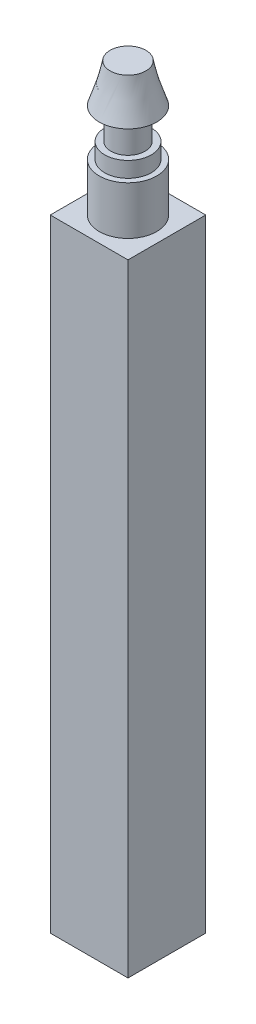
ISO-10303-21;
HEADER;
FILE_DESCRIPTION(('STEP AP214'),'2;1');
FILE_NAME('part.step','',(''),(''),'','','');
FILE_SCHEMA(('AUTOMOTIVE_DESIGN { 1 0 10303 214 1 1 1 1 }'));
ENDSEC;
DATA;
#1=APPLICATION_CONTEXT('core data for automotive mechanical design processes');
#2=APPLICATION_PROTOCOL_DEFINITION('international standard','automotive_design',2000,#1);
#3=PRODUCT_CONTEXT('',#1,'mechanical');
#4=PRODUCT('Part','Part','',(#3));
#5=PRODUCT_RELATED_PRODUCT_CATEGORY('part','',(#4));
#6=PRODUCT_DEFINITION_FORMATION('','',#4);
#7=PRODUCT_DEFINITION_CONTEXT('part definition',#1,'design');
#8=PRODUCT_DEFINITION('design','',#6,#7);
#9=PRODUCT_DEFINITION_SHAPE('','',#8);
#10=(LENGTH_UNIT() NAMED_UNIT(*) SI_UNIT(.MILLI.,.METRE.));
#11=(NAMED_UNIT(*) PLANE_ANGLE_UNIT() SI_UNIT($,.RADIAN.));
#12=(NAMED_UNIT(*) SI_UNIT($,.STERADIAN.) SOLID_ANGLE_UNIT());
#13=UNCERTAINTY_MEASURE_WITH_UNIT(LENGTH_MEASURE(1.E-05),#10,'distance_accuracy_value','');
#14=(GEOMETRIC_REPRESENTATION_CONTEXT(3) GLOBAL_UNCERTAINTY_ASSIGNED_CONTEXT((#13)) GLOBAL_UNIT_ASSIGNED_CONTEXT((#10,
#11,#12)) REPRESENTATION_CONTEXT('',''));
#15=CARTESIAN_POINT('',(0.,0.,0.));
#16=DIRECTION('',(0.,0.,1.));
#17=DIRECTION('',(1.,0.,0.));
#18=AXIS2_PLACEMENT_3D('',#15,#16,#17);
#19=CARTESIAN_POINT('',(0.,3.1,0.));
#20=DIRECTION('',(0.,-1.,0.));
#21=DIRECTION('',(0.,0.,-1.));
#22=AXIS2_PLACEMENT_3D('',#19,#20,#21);
#23=CYLINDRICAL_SURFACE('',#22,1.85);
#24=CARTESIAN_POINT('',(0.,3.1,0.));
#25=DIRECTION('',(0.,1.,0.));
#26=DIRECTION('',(0.,0.,1.));
#27=AXIS2_PLACEMENT_3D('',#24,#25,#26);
#28=CIRCLE('',#27,1.85);
#29=CARTESIAN_POINT('',(0.,3.1,-1.85));
#30=VERTEX_POINT('',#29);
#31=EDGE_CURVE('E174',#30,#30,#28,.T.);
#32=CARTESIAN_POINT('',(0.,0.,0.));
#33=DIRECTION('',(0.,1.,0.));
#34=DIRECTION('',(0.,0.,1.));
#35=AXIS2_PLACEMENT_3D('',#32,#33,#34);
#36=CIRCLE('',#35,1.85);
#37=CARTESIAN_POINT('',(0.,0.,-1.85));
#38=VERTEX_POINT('',#37);
#39=EDGE_CURVE('E41',#38,#38,#36,.T.);
#40=CARTESIAN_POINT('',(0.,3.1,-1.85));
#41=CARTESIAN_POINT('',(0.,3.06770833333333,-1.85));
#42=CARTESIAN_POINT('',(0.,3.03541666666667,-1.85));
#43=CARTESIAN_POINT('',(0.,2.97083333333333,-1.85));
#44=CARTESIAN_POINT('',(0.,2.93854166666667,-1.85));
#45=CARTESIAN_POINT('',(0.,2.87395833333333,-1.85));
#46=CARTESIAN_POINT('',(0.,2.84166666666667,-1.85));
#47=CARTESIAN_POINT('',(0.,2.77708333333333,-1.85));
#48=CARTESIAN_POINT('',(0.,2.74479166666667,-1.85));
#49=CARTESIAN_POINT('',(0.,2.68020833333333,-1.85));
#50=CARTESIAN_POINT('',(0.,2.64791666666667,-1.85));
#51=CARTESIAN_POINT('',(0.,2.58333333333333,-1.85));
#52=CARTESIAN_POINT('',(0.,2.55104166666667,-1.85));
#53=CARTESIAN_POINT('',(0.,2.48645833333333,-1.85));
#54=CARTESIAN_POINT('',(0.,2.45416666666667,-1.85));
#55=CARTESIAN_POINT('',(0.,2.38958333333333,-1.85));
#56=CARTESIAN_POINT('',(0.,2.35729166666667,-1.85));
#57=CARTESIAN_POINT('',(0.,2.29270833333333,-1.85));
#58=CARTESIAN_POINT('',(0.,2.26041666666667,-1.85));
#59=CARTESIAN_POINT('',(0.,2.19583333333333,-1.85));
#60=CARTESIAN_POINT('',(0.,2.16354166666667,-1.85));
#61=CARTESIAN_POINT('',(0.,2.09895833333333,-1.85));
#62=CARTESIAN_POINT('',(0.,2.06666666666667,-1.85));
#63=CARTESIAN_POINT('',(0.,2.00208333333333,-1.85));
#64=CARTESIAN_POINT('',(0.,1.96979166666667,-1.85));
#65=CARTESIAN_POINT('',(0.,1.90520833333333,-1.85));
#66=CARTESIAN_POINT('',(0.,1.87291666666667,-1.85));
#67=CARTESIAN_POINT('',(0.,1.80833333333333,-1.85));
#68=CARTESIAN_POINT('',(0.,1.77604166666667,-1.85));
#69=CARTESIAN_POINT('',(0.,1.71145833333333,-1.85));
#70=CARTESIAN_POINT('',(0.,1.67916666666667,-1.85));
#71=CARTESIAN_POINT('',(0.,1.61458333333333,-1.85));
#72=CARTESIAN_POINT('',(0.,1.58229166666667,-1.85));
#73=CARTESIAN_POINT('',(0.,1.51770833333333,-1.85));
#74=CARTESIAN_POINT('',(0.,1.48541666666667,-1.85));
#75=CARTESIAN_POINT('',(0.,1.42083333333333,-1.85));
#76=CARTESIAN_POINT('',(0.,1.38854166666667,-1.85));
#77=CARTESIAN_POINT('',(0.,1.32395833333333,-1.85));
#78=CARTESIAN_POINT('',(0.,1.29166666666667,-1.85));
#79=CARTESIAN_POINT('',(0.,1.22708333333333,-1.85));
#80=CARTESIAN_POINT('',(0.,1.19479166666667,-1.85));
#81=CARTESIAN_POINT('',(0.,1.13020833333333,-1.85));
#82=CARTESIAN_POINT('',(0.,1.09791666666667,-1.85));
#83=CARTESIAN_POINT('',(0.,1.03333333333333,-1.85));
#84=CARTESIAN_POINT('',(0.,1.00104166666667,-1.85));
#85=CARTESIAN_POINT('',(0.,0.936458333333333,-1.85));
#86=CARTESIAN_POINT('',(0.,0.904166666666667,-1.85));
#87=CARTESIAN_POINT('',(0.,0.839583333333333,-1.85));
#88=CARTESIAN_POINT('',(0.,0.807291666666667,-1.85));
#89=CARTESIAN_POINT('',(0.,0.742708333333333,-1.85));
#90=CARTESIAN_POINT('',(0.,0.710416666666667,-1.85));
#91=CARTESIAN_POINT('',(0.,0.645833333333333,-1.85));
#92=CARTESIAN_POINT('',(0.,0.613541666666667,-1.85));
#93=CARTESIAN_POINT('',(0.,0.548958333333333,-1.85));
#94=CARTESIAN_POINT('',(0.,0.516666666666667,-1.85));
#95=CARTESIAN_POINT('',(0.,0.452083333333333,-1.85));
#96=CARTESIAN_POINT('',(0.,0.419791666666667,-1.85));
#97=CARTESIAN_POINT('',(0.,0.355208333333333,-1.85));
#98=CARTESIAN_POINT('',(0.,0.322916666666667,-1.85));
#99=CARTESIAN_POINT('',(0.,0.258333333333333,-1.85));
#100=CARTESIAN_POINT('',(0.,0.226041666666667,-1.85));
#101=CARTESIAN_POINT('',(0.,0.161458333333333,-1.85));
#102=CARTESIAN_POINT('',(0.,0.129166666666667,-1.85));
#103=CARTESIAN_POINT('',(0.,0.0645833333333335,-1.85));
#104=CARTESIAN_POINT('',(0.,0.0322916666666667,-1.85));
#105=CARTESIAN_POINT('',(0.,0.,-1.85));
#106=B_SPLINE_CURVE_WITH_KNOTS('',3,(#40,#41,#42,#43,#44,#45,#46,#47,#48,#49,#50,#51,#52,#53,
#54,#55,#56,#57,#58,#59,#60,#61,#62,#63,#64,#65,#66,#67,#68,#69,#70,#71,#72,#73,#74,#75,#76,#77,
#78,#79,#80,#81,#82,#83,#84,#85,#86,#87,#88,#89,#90,#91,#92,#93,#94,#95,#96,#97,#98,#99,#100,
#101,#102,#103,#104,#105),.UNSPECIFIED.,.F.,.F.,(4,2,2,2,2,2,2,2,2,2,2,2,2,2,2,2,2,2,2,2,2,2,2,
2,2,2,2,2,2,2,2,2,4),(0.,0.0968749999999997,0.19375,0.290625,0.3875,0.484375,0.58125,0.678125,
0.775,0.871874999999999,0.96875,1.065625,1.1625,1.259375,1.35625,1.453125,1.55,1.646875,1.74375,
1.840625,1.9375,2.034375,2.13125,2.228125,2.325,2.421875,2.51875,2.615625,2.7125,2.809375,
2.90625,3.003125,3.1),.UNSPECIFIED.);
#107=EDGE_CURVE('BSEAM38',#30,#38,#106,.T.);
#108=ORIENTED_EDGE('',*,*,#31,.F.);
#109=ORIENTED_EDGE('',*,*,#39,.T.);
#110=ORIENTED_EDGE('',*,*,#107,.T.);
#111=ORIENTED_EDGE('',*,*,#107,.F.);
#112=EDGE_LOOP('',(#108,#110,#109,#111));
#113=FACE_BOUND('',#112,.T.);
#114=ADVANCED_FACE('F38',(#113),#23,.T.);
#115=CARTESIAN_POINT('',(0.,3.1,0.));
#116=DIRECTION('',(0.,1.,0.));
#117=DIRECTION('',(0.,0.,1.));
#118=AXIS2_PLACEMENT_3D('',#115,#116,#117);
#119=PLANE('',#118);
#120=CARTESIAN_POINT('',(0.,3.1,0.));
#121=DIRECTION('',(0.,1.,0.));
#122=DIRECTION('',(0.,0.,1.));
#123=AXIS2_PLACEMENT_3D('',#120,#121,#122);
#124=CIRCLE('',#123,1.5);
#125=CARTESIAN_POINT('',(0.,3.1,1.5));
#126=VERTEX_POINT('',#125);
#127=EDGE_CURVE('E47',#126,#126,#124,.T.);
#128=ORIENTED_EDGE('',*,*,#127,.F.);
#129=EDGE_LOOP('',(#128));
#130=FACE_BOUND('',#129,.T.);
#131=ORIENTED_EDGE('',*,*,#31,.T.);
#132=EDGE_LOOP('',(#131));
#133=FACE_BOUND('',#132,.T.);
#134=ADVANCED_FACE('F179',(#130,#133),#119,.T.);
#135=CARTESIAN_POINT('',(0.,4.1,0.));
#136=DIRECTION('',(0.,-1.,0.));
#137=DIRECTION('',(0.,0.,-1.));
#138=AXIS2_PLACEMENT_3D('',#135,#136,#137);
#139=CYLINDRICAL_SURFACE('',#138,1.5);
#140=CARTESIAN_POINT('',(0.,4.1,0.));
#141=DIRECTION('',(0.,1.,0.));
#142=DIRECTION('',(0.,0.,1.));
#143=AXIS2_PLACEMENT_3D('',#140,#141,#142);
#144=CIRCLE('',#143,1.5);
#145=CARTESIAN_POINT('',(0.,4.1,1.5));
#146=VERTEX_POINT('',#145);
#147=EDGE_CURVE('E170',#146,#146,#144,.T.);
#148=ORIENTED_EDGE('',*,*,#147,.F.);
#149=EDGE_LOOP('',(#148));
#150=FACE_BOUND('',#149,.T.);
#151=ORIENTED_EDGE('',*,*,#127,.T.);
#152=EDGE_LOOP('',(#151));
#153=FACE_BOUND('',#152,.T.);
#154=ADVANCED_FACE('F202',(#150,#153),#139,.T.);
#155=CARTESIAN_POINT('',(0.,4.1,0.));
#156=DIRECTION('',(0.,1.,0.));
#157=DIRECTION('',(0.,0.,1.));
#158=AXIS2_PLACEMENT_3D('',#155,#156,#157);
#159=PLANE('',#158);
#160=CARTESIAN_POINT('',(0.,4.1,0.));
#161=DIRECTION('',(0.,1.,0.));
#162=DIRECTION('',(0.,0.,1.));
#163=AXIS2_PLACEMENT_3D('',#160,#161,#162);
#164=CIRCLE('',#163,1.1);
#165=CARTESIAN_POINT('',(0.,4.1,1.1));
#166=VERTEX_POINT('',#165);
#167=EDGE_CURVE('E12',#166,#166,#164,.T.);
#168=ORIENTED_EDGE('',*,*,#167,.F.);
#169=EDGE_LOOP('',(#168));
#170=FACE_BOUND('',#169,.T.);
#171=ORIENTED_EDGE('',*,*,#147,.T.);
#172=EDGE_LOOP('',(#171));
#173=FACE_BOUND('',#172,.T.);
#174=ADVANCED_FACE('F197',(#170,#173),#159,.T.);
#175=CARTESIAN_POINT('',(0.,6.1,0.));
#176=DIRECTION('',(0.,-1.,0.));
#177=DIRECTION('',(0.,0.,-1.));
#178=AXIS2_PLACEMENT_3D('',#175,#176,#177);
#179=CYLINDRICAL_SURFACE('',#178,1.1);
#180=CARTESIAN_POINT('',(0.,6.1,0.));
#181=DIRECTION('',(0.,1.,0.));
#182=DIRECTION('',(0.,0.,1.));
#183=AXIS2_PLACEMENT_3D('',#180,#181,#182);
#184=CIRCLE('',#183,1.1);
#185=CARTESIAN_POINT('',(0.,6.1,1.1));
#186=VERTEX_POINT('',#185);
#187=EDGE_CURVE('E166',#186,#186,#184,.T.);
#188=ORIENTED_EDGE('',*,*,#187,.F.);
#189=EDGE_LOOP('',(#188));
#190=FACE_BOUND('',#189,.T.);
#191=ORIENTED_EDGE('',*,*,#167,.T.);
#192=EDGE_LOOP('',(#191));
#193=FACE_BOUND('',#192,.T.);
#194=ADVANCED_FACE('F153',(#190,#193),#179,.T.);
#195=CARTESIAN_POINT('',(0.,8.6,0.));
#196=DIRECTION('',(0.,1.,0.));
#197=DIRECTION('',(0.,0.,1.));
#198=AXIS2_PLACEMENT_3D('',#195,#196,#197);
#199=PLANE('',#198);
#200=CARTESIAN_POINT('',(0.,8.6,0.));
#201=DIRECTION('',(0.,1.,0.));
#202=DIRECTION('',(0.,0.,1.));
#203=AXIS2_PLACEMENT_3D('',#200,#201,#202);
#204=CIRCLE('',#203,1.15);
#205=CARTESIAN_POINT('',(0.620465420838555,8.6,0.968257538851949));
#206=VERTEX_POINT('',#205);
#207=EDGE_CURVE('E121',#206,#206,#204,.T.);
#208=ORIENTED_EDGE('',*,*,#207,.T.);
#209=EDGE_LOOP('',(#208));
#210=FACE_BOUND('',#209,.T.);
#211=ADVANCED_FACE('F144',(#210),#199,.T.);
#212=CARTESIAN_POINT('',(0.,6.1,0.));
#213=DIRECTION('',(0.,1.,0.));
#214=DIRECTION('',(0.,0.,1.));
#215=AXIS2_PLACEMENT_3D('',#212,#213,#214);
#216=PLANE('',#215);
#217=ORIENTED_EDGE('',*,*,#187,.T.);
#218=EDGE_LOOP('',(#217));
#219=FACE_BOUND('',#218,.T.);
#220=CARTESIAN_POINT('',(0.,6.1,0.));
#221=DIRECTION('',(0.,1.,0.));
#222=DIRECTION('',(0.,0.,1.));
#223=AXIS2_PLACEMENT_3D('',#220,#221,#222);
#224=CIRCLE('',#223,1.85);
#225=CARTESIAN_POINT('',(0.,6.1,1.85));
#226=VERTEX_POINT('',#225);
#227=EDGE_CURVE('E126',#226,#226,#224,.T.);
#228=ORIENTED_EDGE('',*,*,#227,.F.);
#229=EDGE_LOOP('',(#228));
#230=FACE_BOUND('',#229,.T.);
#231=ADVANCED_FACE('F141',(#219,#230),#216,.F.);
#232=CARTESIAN_POINT('',(0.,6.1,1.85));
#233=CARTESIAN_POINT('',(0.620465420838555,8.6,0.968257538851949));
#234=CARTESIAN_POINT('',(3.7,6.1,1.85));
#235=CARTESIAN_POINT('',(2.55698049854245,8.6,-0.272673302825161));
#236=CARTESIAN_POINT('',(3.7,6.1,-1.85));
#237=CARTESIAN_POINT('',(1.31604965686534,8.6,-2.20918838052906));
#238=CARTESIAN_POINT('',(0.,6.1,-1.85));
#239=CARTESIAN_POINT('',(-0.620465420838555,8.6,-0.96825753885195));
#240=CARTESIAN_POINT('',(-3.7,6.1,-1.85));
#241=CARTESIAN_POINT('',(-2.55698049854246,8.6,0.272673302825162));
#242=CARTESIAN_POINT('',(-3.7,6.1,1.85));
#243=CARTESIAN_POINT('',(-1.31604965686534,8.6,2.20918838052906));
#244=CARTESIAN_POINT('',(0.,6.1,1.85));
#245=CARTESIAN_POINT('',(0.620465420838555,8.6,0.968257538851949));
#246=(BOUNDED_SURFACE() B_SPLINE_SURFACE(3,1,((#232,#233),(#234,#235),(#236,#237),(#238,#239),
(#240,#241),(#242,#243),(#244,#245)),.UNSPECIFIED.,.T.,.F.,.F.) B_SPLINE_SURFACE_WITH_KNOTS((4,
3,4),(2,2),(0.,0.5,1.),(0.,1.),
.UNSPECIFIED.) GEOMETRIC_REPRESENTATION_ITEM() RATIONAL_B_SPLINE_SURFACE(((1.,1.),
(0.333333333333333,0.333333333333333),(0.333333333333333,0.333333333333333),(1.,1.),
(0.333333333333333,0.333333333333333),(0.333333333333333,0.333333333333333),(1.,1.))) REPRESENTATION_ITEM('') SURFACE());
#247=CARTESIAN_POINT('',(0.,6.1,1.85));
#248=CARTESIAN_POINT('',(0.00646318146706835,6.12604166666667,1.84081518269637));
#249=CARTESIAN_POINT('',(0.0129263629341366,6.15208333333333,1.83163036539275));
#250=CARTESIAN_POINT('',(0.0258527258682731,6.20416666666667,1.8132607307855));
#251=CARTESIAN_POINT('',(0.0323159073353414,6.23020833333333,1.80407591348187));
#252=CARTESIAN_POINT('',(0.045242270269478,6.28229166666667,1.78570627887462));
#253=CARTESIAN_POINT('',(0.0517054517365463,6.30833333333333,1.776521461571));
#254=CARTESIAN_POINT('',(0.0646318146706829,6.36041666666667,1.75815182696374));
#255=CARTESIAN_POINT('',(0.0710949961377511,6.38645833333333,1.74896700966012));
#256=CARTESIAN_POINT('',(0.0840213590718877,6.43854166666667,1.73059737505287));
#257=CARTESIAN_POINT('',(0.090484540538956,6.46458333333333,1.72141255774924));
#258=CARTESIAN_POINT('',(0.103410903473093,6.51666666666667,1.70304292314199));
#259=CARTESIAN_POINT('',(0.109874084940161,6.54270833333333,1.69385810583837));
#260=CARTESIAN_POINT('',(0.122800447874297,6.59479166666667,1.67548847123112));
#261=CARTESIAN_POINT('',(0.129263629341366,6.62083333333333,1.66630365392749));
#262=CARTESIAN_POINT('',(0.142189992275502,6.67291666666667,1.64793401932024));
#263=CARTESIAN_POINT('',(0.148653173742571,6.69895833333333,1.63874920201661));
#264=CARTESIAN_POINT('',(0.161579536676707,6.75104166666667,1.62037956740936));
#265=CARTESIAN_POINT('',(0.168042718143775,6.77708333333333,1.61119475010574));
#266=CARTESIAN_POINT('',(0.180969081077912,6.82916666666667,1.59282511549849));
#267=CARTESIAN_POINT('',(0.18743226254498,6.85520833333333,1.58364029819486));
#268=CARTESIAN_POINT('',(0.200358625479117,6.90729166666667,1.56527066358761));
#269=CARTESIAN_POINT('',(0.206821806946185,6.93333333333333,1.55608584628398));
#270=CARTESIAN_POINT('',(0.219748169880322,6.98541666666667,1.53771621167673));
#271=CARTESIAN_POINT('',(0.22621135134739,7.01145833333333,1.52853139437311));
#272=CARTESIAN_POINT('',(0.239137714281527,7.06354166666667,1.51016175976586));
#273=CARTESIAN_POINT('',(0.245600895748595,7.08958333333333,1.50097694246223));
#274=CARTESIAN_POINT('',(0.258527258682731,7.14166666666667,1.48260730785498));
#275=CARTESIAN_POINT('',(0.2649904401498,7.16770833333333,1.47342249055135));
#276=CARTESIAN_POINT('',(0.277916803083936,7.21979166666667,1.4550528559441));
#277=CARTESIAN_POINT('',(0.284379984551005,7.24583333333333,1.44586803864048));
#278=CARTESIAN_POINT('',(0.297306347485141,7.29791666666667,1.42749840403323));
#279=CARTESIAN_POINT('',(0.303769528952209,7.32395833333333,1.4183135867296));
#280=CARTESIAN_POINT('',(0.316695891886346,7.37604166666667,1.39994395212235));
#281=CARTESIAN_POINT('',(0.323159073353414,7.40208333333333,1.39075913481872));
#282=CARTESIAN_POINT('',(0.336085436287551,7.45416666666667,1.37238950021147));
#283=CARTESIAN_POINT('',(0.342548617754619,7.48020833333333,1.36320468290785));
#284=CARTESIAN_POINT('',(0.355474980688756,7.53229166666667,1.3448350483006));
#285=CARTESIAN_POINT('',(0.361938162155824,7.55833333333333,1.33565023099697));
#286=CARTESIAN_POINT('',(0.374864525089961,7.61041666666667,1.31728059638972));
#287=CARTESIAN_POINT('',(0.381327706557029,7.63645833333333,1.30809577908609));
#288=CARTESIAN_POINT('',(0.394254069491165,7.68854166666667,1.28972614447884));
#289=CARTESIAN_POINT('',(0.400717250958234,7.71458333333333,1.28054132717522));
#290=CARTESIAN_POINT('',(0.41364361389237,7.76666666666667,1.26217169256797));
#291=CARTESIAN_POINT('',(0.420106795359439,7.79270833333333,1.25298687526434));
#292=CARTESIAN_POINT('',(0.433033158293575,7.84479166666667,1.23461724065709));
#293=CARTESIAN_POINT('',(0.439496339760643,7.87083333333333,1.22543242335346));
#294=CARTESIAN_POINT('',(0.45242270269478,7.92291666666667,1.20706278874621));
#295=CARTESIAN_POINT('',(0.458885884161848,7.94895833333333,1.19787797144259));
#296=CARTESIAN_POINT('',(0.471812247095985,8.00104166666667,1.17950833683534));
#297=CARTESIAN_POINT('',(0.478275428563053,8.02708333333333,1.17032351953171));
#298=CARTESIAN_POINT('',(0.49120179149719,8.07916666666667,1.15195388492446));
#299=CARTESIAN_POINT('',(0.497664972964258,8.10520833333333,1.14276906762083));
#300=CARTESIAN_POINT('',(0.510591335898395,8.15729166666667,1.12439943301358));
#301=CARTESIAN_POINT('',(0.517054517365463,8.18333333333333,1.11521461570996));
#302=CARTESIAN_POINT('',(0.529980880299599,8.23541666666667,1.09684498110271));
#303=CARTESIAN_POINT('',(0.536444061766668,8.26145833333333,1.08766016379908));
#304=CARTESIAN_POINT('',(0.549370424700804,8.31354166666667,1.06929052919183));
#305=CARTESIAN_POINT('',(0.555833606167872,8.33958333333333,1.0601057118882));
#306=CARTESIAN_POINT('',(0.568759969102009,8.39166666666667,1.04173607728095));
#307=CARTESIAN_POINT('',(0.575223150569077,8.41770833333333,1.03255125997733));
#308=CARTESIAN_POINT('',(0.588149513503214,8.46979166666667,1.01418162537008));
#309=CARTESIAN_POINT('',(0.594612694970282,8.49583333333333,1.00499680806645));
#310=CARTESIAN_POINT('',(0.607539057904419,8.54791666666667,0.9866271734592));
#311=CARTESIAN_POINT('',(0.614002239371487,8.57395833333333,0.977442356155575));
#312=CARTESIAN_POINT('',(0.620465420838555,8.6,0.968257538851949));
#313=B_SPLINE_CURVE_WITH_KNOTS('',3,(#247,#248,#249,#250,#251,#252,#253,#254,#255,#256,#257,
#258,#259,#260,#261,#262,#263,#264,#265,#266,#267,#268,#269,#270,#271,#272,#273,#274,#275,#276,
#277,#278,#279,#280,#281,#282,#283,#284,#285,#286,#287,#288,#289,#290,#291,#292,#293,#294,#295,
#296,#297,#298,#299,#300,#301,#302,#303,#304,#305,#306,#307,#308,#309,#310,#311,#312),
.UNSPECIFIED.,.F.,.F.,(4,2,2,2,2,2,2,2,2,2,2,2,2,2,2,2,2,2,2,2,2,2,2,2,2,2,2,2,2,2,2,2,4),(0.,
0.0850806551290898,0.17016131025818,0.255241965387269,0.340322620516359,0.425403275645449,
0.510483930774539,0.595564585903629,0.680645241032718,0.765725896161807,0.850806551290897,
0.935887206419988,1.02096786154908,1.10604851667817,1.19112917180726,1.27620982693635,
1.36129048206544,1.44637113719453,1.53145179232361,1.6165324474527,1.70161310258179,
1.78669375771088,1.87177441283997,1.95685506796906,2.04193572309815,2.12701637822724,
2.21209703335633,2.29717768848542,2.38225834361451,2.4673389987436,2.55241965387269,
2.63750030900178,2.72258096413087),.UNSPECIFIED.);
#314=EDGE_CURVE('BSEAM128',#226,#206,#313,.T.);
#315=ORIENTED_EDGE('',*,*,#227,.T.);
#316=ORIENTED_EDGE('',*,*,#207,.F.);
#317=ORIENTED_EDGE('',*,*,#314,.T.);
#318=ORIENTED_EDGE('',*,*,#314,.F.);
#319=EDGE_LOOP('',(#315,#317,#316,#318));
#320=FACE_BOUND('',#319,.T.);
#321=ADVANCED_FACE('F128',(#320),#246,.T.);
#322=CARTESIAN_POINT('',(2.5,-40.,2.5));
#323=DIRECTION('',(-1.,0.,0.));
#324=DIRECTION('',(0.,0.,1.));
#325=AXIS2_PLACEMENT_3D('',#322,#323,#324);
#326=PLANE('',#325);
#327=DIRECTION('',(0.,0.,1.));
#328=VECTOR('',#327,1.);
#329=CARTESIAN_POINT('',(2.5,0.,2.5));
#330=LINE('',#329,#328);
#331=CARTESIAN_POINT('',(2.5,0.,-2.5));
#332=VERTEX_POINT('',#331);
#333=CARTESIAN_POINT('',(2.5,0.,2.5));
#334=VERTEX_POINT('',#333);
#335=EDGE_CURVE('E107',#332,#334,#330,.T.);
#336=ORIENTED_EDGE('',*,*,#335,.T.);
#337=DIRECTION('',(0.,1.,0.));
#338=VECTOR('',#337,1.);
#339=CARTESIAN_POINT('',(2.5,-40.,2.5));
#340=LINE('',#339,#338);
#341=CARTESIAN_POINT('',(2.5,-40.,2.5));
#342=VERTEX_POINT('',#341);
#343=EDGE_CURVE('E98',#342,#334,#340,.T.);
#344=ORIENTED_EDGE('',*,*,#343,.F.);
#345=DIRECTION('',(0.,0.,1.));
#346=VECTOR('',#345,1.);
#347=CARTESIAN_POINT('',(2.5,-40.,2.5));
#348=LINE('',#347,#346);
#349=CARTESIAN_POINT('',(2.5,-40.,-2.5));
#350=VERTEX_POINT('',#349);
#351=EDGE_CURVE('E92',#350,#342,#348,.T.);
#352=ORIENTED_EDGE('',*,*,#351,.F.);
#353=DIRECTION('',(0.,1.,0.));
#354=VECTOR('',#353,1.);
#355=CARTESIAN_POINT('',(2.5,-40.,-2.5));
#356=LINE('',#355,#354);
#357=EDGE_CURVE('E103',#350,#332,#356,.T.);
#358=ORIENTED_EDGE('',*,*,#357,.T.);
#359=EDGE_LOOP('',(#336,#344,#352,#358));
#360=FACE_BOUND('',#359,.T.);
#361=ADVANCED_FACE('F140',(#360),#326,.F.);
#362=CARTESIAN_POINT('',(-2.5,-40.,2.5));
#363=DIRECTION('',(0.,0.,-1.));
#364=DIRECTION('',(-1.,0.,0.));
#365=AXIS2_PLACEMENT_3D('',#362,#363,#364);
#366=PLANE('',#365);
#367=DIRECTION('',(-1.,0.,0.));
#368=VECTOR('',#367,1.);
#369=CARTESIAN_POINT('',(-2.5,0.,2.5));
#370=LINE('',#369,#368);
#371=CARTESIAN_POINT('',(-2.5,0.,2.5));
#372=VERTEX_POINT('',#371);
#373=EDGE_CURVE('E97',#334,#372,#370,.T.);
#374=ORIENTED_EDGE('',*,*,#373,.T.);
#375=DIRECTION('',(0.,1.,0.));
#376=VECTOR('',#375,1.);
#377=CARTESIAN_POINT('',(-2.5,-40.,2.5));
#378=LINE('',#377,#376);
#379=CARTESIAN_POINT('',(-2.5,-40.,2.5));
#380=VERTEX_POINT('',#379);
#381=EDGE_CURVE('E95',#380,#372,#378,.T.);
#382=ORIENTED_EDGE('',*,*,#381,.F.);
#383=DIRECTION('',(-1.,0.,0.));
#384=VECTOR('',#383,1.);
#385=CARTESIAN_POINT('',(-2.5,-40.,2.5));
#386=LINE('',#385,#384);
#387=EDGE_CURVE('E87',#342,#380,#386,.T.);
#388=ORIENTED_EDGE('',*,*,#387,.F.);
#389=ORIENTED_EDGE('',*,*,#343,.T.);
#390=EDGE_LOOP('',(#374,#382,#388,#389));
#391=FACE_BOUND('',#390,.T.);
#392=ADVANCED_FACE('F96',(#391),#366,.F.);
#393=CARTESIAN_POINT('',(-2.5,-40.,2.5));
#394=DIRECTION('',(1.,0.,0.));
#395=DIRECTION('',(0.,0.,-1.));
#396=AXIS2_PLACEMENT_3D('',#393,#394,#395);
#397=PLANE('',#396);
#398=DIRECTION('',(0.,0.,-1.));
#399=VECTOR('',#398,1.);
#400=CARTESIAN_POINT('',(-2.5,0.,2.5));
#401=LINE('',#400,#399);
#402=CARTESIAN_POINT('',(-2.5,0.,-2.5));
#403=VERTEX_POINT('',#402);
#404=EDGE_CURVE('E73',#372,#403,#401,.T.);
#405=ORIENTED_EDGE('',*,*,#404,.T.);
#406=DIRECTION('',(0.,1.,0.));
#407=VECTOR('',#406,1.);
#408=CARTESIAN_POINT('',(-2.5,-40.,-2.5));
#409=LINE('',#408,#407);
#410=CARTESIAN_POINT('',(-2.5,-40.,-2.5));
#411=VERTEX_POINT('',#410);
#412=EDGE_CURVE('E99',#411,#403,#409,.T.);
#413=ORIENTED_EDGE('',*,*,#412,.F.);
#414=DIRECTION('',(0.,0.,-1.));
#415=VECTOR('',#414,1.);
#416=CARTESIAN_POINT('',(-2.5,-40.,2.5));
#417=LINE('',#416,#415);
#418=EDGE_CURVE('E90',#380,#411,#417,.T.);
#419=ORIENTED_EDGE('',*,*,#418,.F.);
#420=ORIENTED_EDGE('',*,*,#381,.T.);
#421=EDGE_LOOP('',(#405,#413,#419,#420));
#422=FACE_BOUND('',#421,.T.);
#423=ADVANCED_FACE('F101',(#422),#397,.F.);
#424=CARTESIAN_POINT('',(-2.5,-40.,-2.5));
#425=DIRECTION('',(0.,0.,1.));
#426=DIRECTION('',(1.,0.,0.));
#427=AXIS2_PLACEMENT_3D('',#424,#425,#426);
#428=PLANE('',#427);
#429=DIRECTION('',(1.,0.,0.));
#430=VECTOR('',#429,1.);
#431=CARTESIAN_POINT('',(-2.5,0.,-2.5));
#432=LINE('',#431,#430);
#433=EDGE_CURVE('E79',#403,#332,#432,.T.);
#434=ORIENTED_EDGE('',*,*,#433,.T.);
#435=ORIENTED_EDGE('',*,*,#357,.F.);
#436=DIRECTION('',(1.,0.,0.));
#437=VECTOR('',#436,1.);
#438=CARTESIAN_POINT('',(-2.5,-40.,-2.5));
#439=LINE('',#438,#437);
#440=EDGE_CURVE('E56',#411,#350,#439,.T.);
#441=ORIENTED_EDGE('',*,*,#440,.F.);
#442=ORIENTED_EDGE('',*,*,#412,.T.);
#443=EDGE_LOOP('',(#434,#435,#441,#442));
#444=FACE_BOUND('',#443,.T.);
#445=ADVANCED_FACE('F266',(#444),#428,.F.);
#446=CARTESIAN_POINT('',(0.,-40.,0.));
#447=DIRECTION('',(0.,-1.,0.));
#448=DIRECTION('',(0.,0.,-1.));
#449=AXIS2_PLACEMENT_3D('',#446,#447,#448);
#450=PLANE('',#449);
#451=CARTESIAN_POINT('',(0.,-40.,0.));
#452=DIRECTION('',(0.,-1.,0.));
#453=DIRECTION('',(0.,0.,-1.));
#454=AXIS2_PLACEMENT_3D('',#451,#452,#453);
#455=CIRCLE('',#454,1.);
#456=CARTESIAN_POINT('',(0.,-40.,-1.));
#457=VERTEX_POINT('',#456);
#458=EDGE_CURVE('E318',#457,#457,#455,.T.);
#459=ORIENTED_EDGE('',*,*,#458,.F.);
#460=EDGE_LOOP('',(#459));
#461=FACE_BOUND('',#460,.T.);
#462=ORIENTED_EDGE('',*,*,#351,.T.);
#463=ORIENTED_EDGE('',*,*,#387,.T.);
#464=ORIENTED_EDGE('',*,*,#418,.T.);
#465=ORIENTED_EDGE('',*,*,#440,.T.);
#466=EDGE_LOOP('',(#462,#463,#464,#465));
#467=FACE_BOUND('',#466,.T.);
#468=ADVANCED_FACE('F88',(#461,#467),#450,.T.);
#469=CARTESIAN_POINT('',(0.,0.,0.));
#470=DIRECTION('',(0.,-1.,0.));
#471=DIRECTION('',(0.,0.,-1.));
#472=AXIS2_PLACEMENT_3D('',#469,#470,#471);
#473=PLANE('',#472);
#474=ORIENTED_EDGE('',*,*,#39,.F.);
#475=EDGE_LOOP('',(#474));
#476=FACE_BOUND('',#475,.T.);
#477=ORIENTED_EDGE('',*,*,#335,.F.);
#478=ORIENTED_EDGE('',*,*,#433,.F.);
#479=ORIENTED_EDGE('',*,*,#404,.F.);
#480=ORIENTED_EDGE('',*,*,#373,.F.);
#481=EDGE_LOOP('',(#477,#478,#479,#480));
#482=FACE_BOUND('',#481,.T.);
#483=ADVANCED_FACE('F281',(#476,#482),#473,.F.);
#484=CARTESIAN_POINT('',(0.,-16.,0.));
#485=DIRECTION('',(0.,-1.,0.));
#486=DIRECTION('',(0.,0.,-1.));
#487=AXIS2_PLACEMENT_3D('',#484,#485,#486);
#488=CYLINDRICAL_SURFACE('',#487,1.);
#489=CARTESIAN_POINT('',(0.,-16.,0.));
#490=DIRECTION('',(0.,-1.,0.));
#491=DIRECTION('',(0.,0.,-1.));
#492=AXIS2_PLACEMENT_3D('',#489,#490,#491);
#493=CIRCLE('',#492,1.);
#494=CARTESIAN_POINT('',(0.,-16.,-1.));
#495=VERTEX_POINT('',#494);
#496=EDGE_CURVE('E110',#495,#495,#493,.T.);
#497=ORIENTED_EDGE('',*,*,#496,.F.);
#498=EDGE_LOOP('',(#497));
#499=FACE_BOUND('',#498,.T.);
#500=ORIENTED_EDGE('',*,*,#458,.T.);
#501=EDGE_LOOP('',(#500));
#502=FACE_BOUND('',#501,.T.);
#503=ADVANCED_FACE('F286',(#499,#502),#488,.F.);
#504=CARTESIAN_POINT('',(0.,-16.,0.));
#505=DIRECTION('',(0.,-1.,0.));
#506=DIRECTION('',(0.,0.,-1.));
#507=AXIS2_PLACEMENT_3D('',#504,#505,#506);
#508=PLANE('',#507);
#509=ORIENTED_EDGE('',*,*,#496,.T.);
#510=EDGE_LOOP('',(#509));
#511=FACE_BOUND('',#510,.T.);
#512=ADVANCED_FACE('F302',(#511),#508,.T.);
#513=CLOSED_SHELL('',(#114,#134,#154,#174,#194,#211,#231,#321,#361,#392,#423,#445,#468,#483,
#503,#512));
#514=MANIFOLD_SOLID_BREP('B2',#513);
#515=ADVANCED_BREP_SHAPE_REPRESENTATION('',(#18,#514),#14);
#516=SHAPE_DEFINITION_REPRESENTATION(#9,#515);
ENDSEC;
END-ISO-10303-21;
